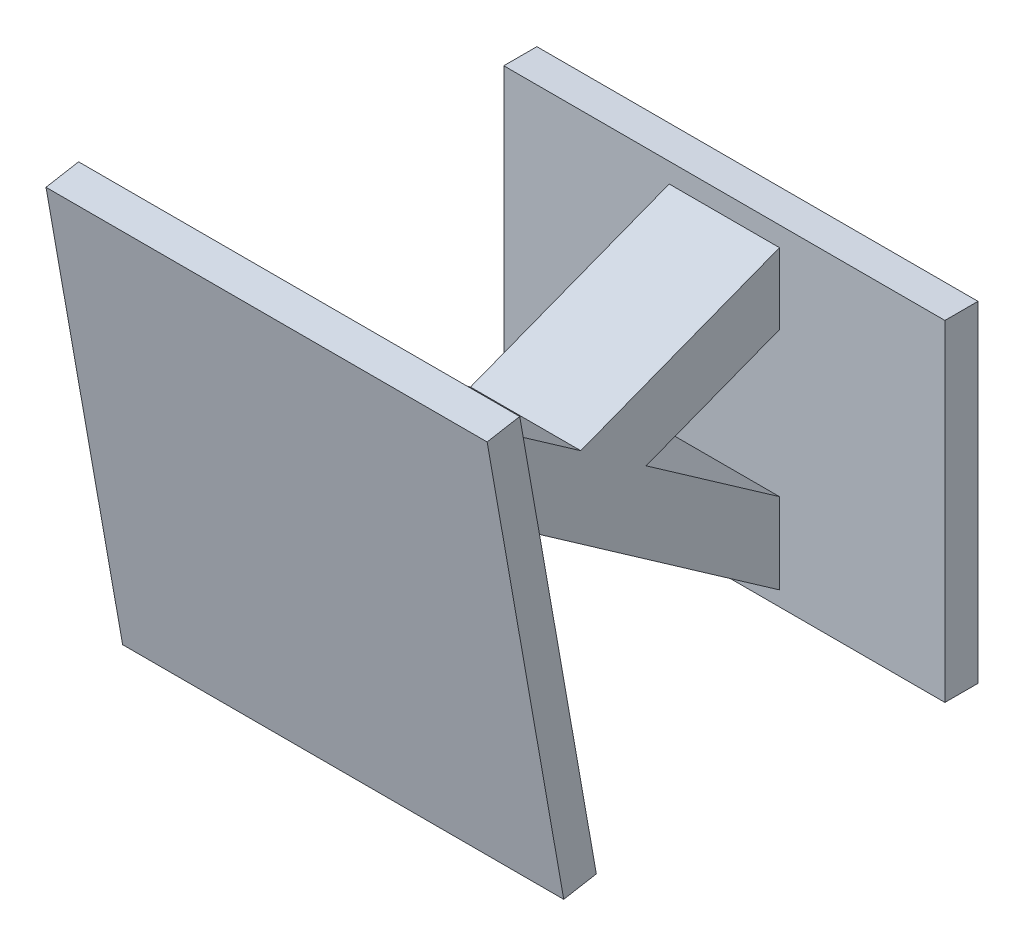
ISO-10303-21;
HEADER;
FILE_DESCRIPTION(('STEP AP214'),'2;1');
FILE_NAME('part.step','',(''),(''),'','','');
FILE_SCHEMA(('AUTOMOTIVE_DESIGN { 1 0 10303 214 1 1 1 1 }'));
ENDSEC;
DATA;
#1=APPLICATION_CONTEXT('core data for automotive mechanical design processes');
#2=APPLICATION_PROTOCOL_DEFINITION('international standard','automotive_design',2000,#1);
#3=PRODUCT_CONTEXT('',#1,'mechanical');
#4=PRODUCT('Part','Part','',(#3));
#5=PRODUCT_RELATED_PRODUCT_CATEGORY('part','',(#4));
#6=PRODUCT_DEFINITION_FORMATION('','',#4);
#7=PRODUCT_DEFINITION_CONTEXT('part definition',#1,'design');
#8=PRODUCT_DEFINITION('design','',#6,#7);
#9=PRODUCT_DEFINITION_SHAPE('','',#8);
#10=(LENGTH_UNIT() NAMED_UNIT(*) SI_UNIT(.MILLI.,.METRE.));
#11=(NAMED_UNIT(*) PLANE_ANGLE_UNIT() SI_UNIT($,.RADIAN.));
#12=(NAMED_UNIT(*) SI_UNIT($,.STERADIAN.) SOLID_ANGLE_UNIT());
#13=UNCERTAINTY_MEASURE_WITH_UNIT(LENGTH_MEASURE(1.E-05),#10,'distance_accuracy_value','');
#14=(GEOMETRIC_REPRESENTATION_CONTEXT(3) GLOBAL_UNCERTAINTY_ASSIGNED_CONTEXT((#13)) GLOBAL_UNIT_ASSIGNED_CONTEXT((#10,
#11,#12)) REPRESENTATION_CONTEXT('',''));
#15=CARTESIAN_POINT('',(0.,0.,0.));
#16=DIRECTION('',(0.,0.,1.));
#17=DIRECTION('',(1.,0.,0.));
#18=AXIS2_PLACEMENT_3D('',#15,#16,#17);
#19=CARTESIAN_POINT('',(5.,-76.5805388747842,53.6222706002861));
#20=DIRECTION('',(0.,-0.81915204428899,0.573576436351049));
#21=DIRECTION('',(0.,-0.573576436351049,-0.81915204428899));
#22=AXIS2_PLACEMENT_3D('',#19,#20,#21);
#23=PLANE('',#22);
#24=DIRECTION('',(0.,0.573576436351049,0.81915204428899));
#25=VECTOR('',#24,1.);
#26=CARTESIAN_POINT('',(-5.,-76.5805388747842,53.6222706002861));
#27=LINE('',#26,#25);
#28=CARTESIAN_POINT('',(-5.,-99.4100833515098,21.0183021610203));
#29=VERTEX_POINT('',#28);
#30=CARTESIAN_POINT('',(-5.,-85.8848490507101,40.3343385684273));
#31=VERTEX_POINT('',#30);
#32=EDGE_CURVE('E226',#29,#31,#27,.T.);
#33=ORIENTED_EDGE('',*,*,#32,.T.);
#34=DIRECTION('',(-1.,0.,0.));
#35=VECTOR('',#34,1.);
#36=CARTESIAN_POINT('',(5.,-85.8848490507101,40.3343385684273));
#37=LINE('',#36,#35);
#38=CARTESIAN_POINT('',(5.,-85.8848490507101,40.3343385684273));
#39=VERTEX_POINT('',#38);
#40=EDGE_CURVE('E11',#39,#31,#37,.T.);
#41=ORIENTED_EDGE('',*,*,#40,.F.);
#42=DIRECTION('',(0.,0.573576436351049,0.81915204428899));
#43=VECTOR('',#42,1.);
#44=CARTESIAN_POINT('',(5.,-76.5805388747842,53.6222706002861));
#45=LINE('',#44,#43);
#46=CARTESIAN_POINT('',(5.,-99.4100833515098,21.0183021610203));
#47=VERTEX_POINT('',#46);
#48=EDGE_CURVE('E89',#47,#39,#45,.T.);
#49=ORIENTED_EDGE('',*,*,#48,.F.);
#50=DIRECTION('',(-1.,0.,0.));
#51=VECTOR('',#50,1.);
#52=CARTESIAN_POINT('',(5.,-99.4100833515098,21.0183021610203));
#53=LINE('',#52,#51);
#54=EDGE_CURVE('E242',#47,#29,#53,.T.);
#55=ORIENTED_EDGE('',*,*,#54,.T.);
#56=EDGE_LOOP('',(#33,#41,#49,#55));
#57=FACE_BOUND('',#56,.T.);
#58=ADVANCED_FACE('F39',(#57),#23,.F.);
#59=CARTESIAN_POINT('',(5.,-81.4954511405181,57.0637292183924));
#60=DIRECTION('',(0.,-0.819152044288989,0.57357643635105));
#61=DIRECTION('',(0.,-0.57357643635105,-0.819152044288989));
#62=AXIS2_PLACEMENT_3D('',#59,#60,#61);
#63=PLANE('',#62);
#64=DIRECTION('',(0.,0.57357643635105,0.819152044288989));
#65=VECTOR('',#64,1.);
#66=CARTESIAN_POINT('',(-5.,-81.4954511405181,57.0637292183924));
#67=LINE('',#66,#65);
#68=CARTESIAN_POINT('',(-5.,-119.351281882965,3.));
#69=VERTEX_POINT('',#68);
#70=CARTESIAN_POINT('',(-5.,-94.2412199345503,38.8608849207996));
#71=VERTEX_POINT('',#70);
#72=EDGE_CURVE('E248',#69,#71,#67,.T.);
#73=ORIENTED_EDGE('',*,*,#72,.F.);
#74=DIRECTION('',(-1.,0.,0.));
#75=VECTOR('',#74,1.);
#76=CARTESIAN_POINT('',(5.,-119.351281882965,3.));
#77=LINE('',#76,#75);
#78=CARTESIAN_POINT('',(5.,-119.351281882965,3.));
#79=VERTEX_POINT('',#78);
#80=EDGE_CURVE('E270',#79,#69,#77,.T.);
#81=ORIENTED_EDGE('',*,*,#80,.F.);
#82=DIRECTION('',(0.,0.57357643635105,0.819152044288989));
#83=VECTOR('',#82,1.);
#84=CARTESIAN_POINT('',(5.,-81.4954511405181,57.0637292183924));
#85=LINE('',#84,#83);
#86=CARTESIAN_POINT('',(5.,-94.2412199345503,38.8608849207996));
#87=VERTEX_POINT('',#86);
#88=EDGE_CURVE('E230',#79,#87,#85,.T.);
#89=ORIENTED_EDGE('',*,*,#88,.T.);
#90=DIRECTION('',(-1.,0.,0.));
#91=VECTOR('',#90,1.);
#92=CARTESIAN_POINT('',(5.,-94.2412199345503,38.8608849207996));
#93=LINE('',#92,#91);
#94=EDGE_CURVE('E47',#87,#71,#93,.T.);
#95=ORIENTED_EDGE('',*,*,#94,.T.);
#96=EDGE_LOOP('',(#73,#81,#89,#95));
#97=FACE_BOUND('',#96,.T.);
#98=ADVANCED_FACE('F275',(#97),#63,.T.);
#99=CARTESIAN_POINT('',(5.,-76.5805388747841,53.6222706002862));
#100=DIRECTION('',(0.,-0.819152044288989,0.57357643635105));
#101=DIRECTION('',(0.,-0.57357643635105,-0.819152044288989));
#102=AXIS2_PLACEMENT_3D('',#99,#100,#101);
#103=PLANE('',#102);
#104=DIRECTION('',(0.,0.57357643635105,0.819152044288989));
#105=VECTOR('',#104,1.);
#106=CARTESIAN_POINT('',(-5.,-76.5805388747841,53.6222706002862));
#107=LINE('',#106,#105);
#108=CARTESIAN_POINT('',(-5.,-112.026634350397,3.));
#109=VERTEX_POINT('',#108);
#110=CARTESIAN_POINT('',(-5.,-103.558646596402,15.0935398319842));
#111=VERTEX_POINT('',#110);
#112=EDGE_CURVE('E253',#109,#111,#107,.T.);
#113=ORIENTED_EDGE('',*,*,#112,.T.);
#114=DIRECTION('',(-1.,0.,0.));
#115=VECTOR('',#114,1.);
#116=CARTESIAN_POINT('',(5.,-103.558646596402,15.0935398319842));
#117=LINE('',#116,#115);
#118=CARTESIAN_POINT('',(5.,-103.558646596402,15.0935398319842));
#119=VERTEX_POINT('',#118);
#120=EDGE_CURVE('E265',#119,#111,#117,.T.);
#121=ORIENTED_EDGE('',*,*,#120,.F.);
#122=DIRECTION('',(0.,0.57357643635105,0.819152044288989));
#123=VECTOR('',#122,1.);
#124=CARTESIAN_POINT('',(5.,-76.5805388747841,53.6222706002862));
#125=LINE('',#124,#123);
#126=CARTESIAN_POINT('',(5.,-112.026634350397,3.));
#127=VERTEX_POINT('',#126);
#128=EDGE_CURVE('E235',#127,#119,#125,.T.);
#129=ORIENTED_EDGE('',*,*,#128,.F.);
#130=DIRECTION('',(-1.,0.,0.));
#131=VECTOR('',#130,1.);
#132=CARTESIAN_POINT('',(5.,-112.026634350397,3.));
#133=LINE('',#132,#131);
#134=EDGE_CURVE('E267',#127,#109,#133,.T.);
#135=ORIENTED_EDGE('',*,*,#134,.T.);
#136=EDGE_LOOP('',(#113,#121,#129,#135));
#137=FACE_BOUND('',#136,.T.);
#138=ADVANCED_FACE('F295',(#137),#103,.F.);
#139=CARTESIAN_POINT('',(5.,-85.1345748268788,-32.7704627871978));
#140=DIRECTION('',(0.,-0.93324862532507,-0.359231128006562));
#141=DIRECTION('',(0.,0.359231128006562,-0.93324862532507));
#142=AXIS2_PLACEMENT_3D('',#139,#140,#141);
#143=PLANE('',#142);
#144=DIRECTION('',(0.,-0.359231128006562,0.93324862532507));
#145=VECTOR('',#144,1.);
#146=CARTESIAN_POINT('',(-5.,-85.1345748268788,-32.7704627871978));
#147=LINE('',#146,#145);
#148=CARTESIAN_POINT('',(-5.,-98.9035355814537,3.));
#149=VERTEX_POINT('',#148);
#150=EDGE_CURVE('E257',#149,#111,#147,.T.);
#151=ORIENTED_EDGE('',*,*,#150,.F.);
#152=DIRECTION('',(-1.,0.,0.));
#153=VECTOR('',#152,1.);
#154=CARTESIAN_POINT('',(5.,-98.9035355814537,3.));
#155=LINE('',#154,#153);
#156=CARTESIAN_POINT('',(5.,-98.9035355814537,3.));
#157=VERTEX_POINT('',#156);
#158=EDGE_CURVE('E77',#157,#149,#155,.T.);
#159=ORIENTED_EDGE('',*,*,#158,.F.);
#160=DIRECTION('',(0.,-0.359231128006562,0.93324862532507));
#161=VECTOR('',#160,1.);
#162=CARTESIAN_POINT('',(5.,-85.1345748268788,-32.7704627871978));
#163=LINE('',#162,#161);
#164=EDGE_CURVE('E238',#157,#119,#163,.T.);
#165=ORIENTED_EDGE('',*,*,#164,.T.);
#166=ORIENTED_EDGE('',*,*,#120,.T.);
#167=EDGE_LOOP('',(#151,#159,#165,#166));
#168=FACE_BOUND('',#167,.T.);
#169=ADVANCED_FACE('F290',(#168),#143,.T.);
#170=CARTESIAN_POINT('',(5.,-79.5350830749284,-30.6150760191584));
#171=DIRECTION('',(0.,-0.93324862532507,-0.359231128006561));
#172=DIRECTION('',(0.,0.359231128006561,-0.93324862532507));
#173=AXIS2_PLACEMENT_3D('',#170,#171,#172);
#174=PLANE('',#173);
#175=DIRECTION('',(0.,-0.359231128006561,0.93324862532507));
#176=VECTOR('',#175,1.);
#177=CARTESIAN_POINT('',(-5.,-79.5350830749284,-30.6150760191584));
#178=LINE('',#177,#176);
#179=CARTESIAN_POINT('',(-5.,-92.4743806519084,3.));
#180=VERTEX_POINT('',#179);
#181=EDGE_CURVE('E84',#180,#29,#178,.T.);
#182=ORIENTED_EDGE('',*,*,#181,.T.);
#183=ORIENTED_EDGE('',*,*,#54,.F.);
#184=DIRECTION('',(0.,-0.359231128006561,0.93324862532507));
#185=VECTOR('',#184,1.);
#186=CARTESIAN_POINT('',(5.,-79.5350830749284,-30.6150760191584));
#187=LINE('',#186,#185);
#188=CARTESIAN_POINT('',(5.,-92.4743806519084,3.));
#189=VERTEX_POINT('',#188);
#190=EDGE_CURVE('E55',#189,#47,#187,.T.);
#191=ORIENTED_EDGE('',*,*,#190,.F.);
#192=DIRECTION('',(-1.,0.,0.));
#193=VECTOR('',#192,1.);
#194=CARTESIAN_POINT('',(5.,-92.4743806519084,3.));
#195=LINE('',#194,#193);
#196=EDGE_CURVE('E262',#189,#180,#195,.T.);
#197=ORIENTED_EDGE('',*,*,#196,.T.);
#198=EDGE_LOOP('',(#182,#183,#191,#197));
#199=FACE_BOUND('',#198,.T.);
#200=ADVANCED_FACE('F284',(#199),#174,.F.);
#201=CARTESIAN_POINT('',(5.,0.,0.));
#202=DIRECTION('',(1.,0.,0.));
#203=DIRECTION('',(0.,0.,-1.));
#204=AXIS2_PLACEMENT_3D('',#201,#202,#203);
#205=PLANE('',#204);
#206=ORIENTED_EDGE('',*,*,#48,.T.);
#207=DIRECTION('',(0.,-0.984807753012208,-0.173648177666931));
#208=VECTOR('',#207,1.);
#209=CARTESIAN_POINT('',(5.,-9.48732320928291,53.8052836336431));
#210=LINE('',#209,#208);
#211=EDGE_CURVE('E228',#39,#87,#210,.T.);
#212=ORIENTED_EDGE('',*,*,#211,.T.);
#213=ORIENTED_EDGE('',*,*,#88,.F.);
#214=DIRECTION('',(0.,-1.,0.));
#215=VECTOR('',#214,1.);
#216=CARTESIAN_POINT('',(5.,0.,3.));
#217=LINE('',#216,#215);
#218=EDGE_CURVE('E233',#127,#79,#217,.T.);
#219=ORIENTED_EDGE('',*,*,#218,.F.);
#220=ORIENTED_EDGE('',*,*,#128,.T.);
#221=ORIENTED_EDGE('',*,*,#164,.F.);
#222=EDGE_CURVE('E236',#189,#157,#217,.T.);
#223=ORIENTED_EDGE('',*,*,#222,.F.);
#224=ORIENTED_EDGE('',*,*,#190,.T.);
#225=EDGE_LOOP('',(#206,#212,#213,#219,#220,#221,#223,#224));
#226=FACE_BOUND('',#225,.T.);
#227=ADVANCED_FACE('F286',(#226),#205,.T.);
#228=CARTESIAN_POINT('',(-5.,0.,0.));
#229=DIRECTION('',(1.,0.,0.));
#230=DIRECTION('',(0.,0.,-1.));
#231=AXIS2_PLACEMENT_3D('',#228,#229,#230);
#232=PLANE('',#231);
#233=ORIENTED_EDGE('',*,*,#32,.F.);
#234=ORIENTED_EDGE('',*,*,#181,.F.);
#235=DIRECTION('',(0.,-1.,0.));
#236=VECTOR('',#235,1.);
#237=CARTESIAN_POINT('',(-5.,0.,3.));
#238=LINE('',#237,#236);
#239=EDGE_CURVE('E254',#180,#149,#238,.T.);
#240=ORIENTED_EDGE('',*,*,#239,.T.);
#241=ORIENTED_EDGE('',*,*,#150,.T.);
#242=ORIENTED_EDGE('',*,*,#112,.F.);
#243=EDGE_CURVE('E250',#109,#69,#238,.T.);
#244=ORIENTED_EDGE('',*,*,#243,.T.);
#245=ORIENTED_EDGE('',*,*,#72,.T.);
#246=DIRECTION('',(0.,-0.984807753012208,-0.173648177666931));
#247=VECTOR('',#246,1.);
#248=CARTESIAN_POINT('',(-5.,-9.48732320928291,53.8052836336431));
#249=LINE('',#248,#247);
#250=EDGE_CURVE('E245',#31,#71,#249,.T.);
#251=ORIENTED_EDGE('',*,*,#250,.F.);
#252=EDGE_LOOP('',(#233,#234,#240,#241,#242,#244,#245,#251));
#253=FACE_BOUND('',#252,.T.);
#254=ADVANCED_FACE('F282',(#253),#232,.F.);
#255=CARTESIAN_POINT('',(20.,0.,0.));
#256=DIRECTION('',(0.,0.,1.));
#257=DIRECTION('',(0.,-1.,0.));
#258=AXIS2_PLACEMENT_3D('',#255,#256,#257);
#259=PLANE('',#258);
#260=DIRECTION('',(0.,1.,0.));
#261=VECTOR('',#260,1.);
#262=CARTESIAN_POINT('',(-20.,0.,0.));
#263=LINE('',#262,#261);
#264=CARTESIAN_POINT('',(-20.,-120.688958116681,0.));
#265=VERTEX_POINT('',#264);
#266=CARTESIAN_POINT('',(-20.,-90.688958116681,0.));
#267=VERTEX_POINT('',#266);
#268=EDGE_CURVE('E186',#265,#267,#263,.T.);
#269=ORIENTED_EDGE('',*,*,#268,.T.);
#270=DIRECTION('',(-1.,0.,0.));
#271=VECTOR('',#270,1.);
#272=CARTESIAN_POINT('',(20.,-90.688958116681,0.));
#273=LINE('',#272,#271);
#274=CARTESIAN_POINT('',(20.,-90.688958116681,0.));
#275=VERTEX_POINT('',#274);
#276=EDGE_CURVE('E223',#275,#267,#273,.T.);
#277=ORIENTED_EDGE('',*,*,#276,.F.);
#278=DIRECTION('',(0.,1.,0.));
#279=VECTOR('',#278,1.);
#280=CARTESIAN_POINT('',(20.,0.,0.));
#281=LINE('',#280,#279);
#282=CARTESIAN_POINT('',(20.,-120.688958116681,0.));
#283=VERTEX_POINT('',#282);
#284=EDGE_CURVE('E200',#283,#275,#281,.T.);
#285=ORIENTED_EDGE('',*,*,#284,.F.);
#286=DIRECTION('',(-1.,0.,0.));
#287=VECTOR('',#286,1.);
#288=CARTESIAN_POINT('',(20.,-120.688958116681,0.));
#289=LINE('',#288,#287);
#290=EDGE_CURVE('E209',#283,#265,#289,.T.);
#291=ORIENTED_EDGE('',*,*,#290,.T.);
#292=EDGE_LOOP('',(#269,#277,#285,#291));
#293=FACE_BOUND('',#292,.T.);
#294=ADVANCED_FACE('F310',(#293),#259,.F.);
#295=CARTESIAN_POINT('',(20.,-90.688958116681,0.));
#296=DIRECTION('',(0.,-1.,0.));
#297=DIRECTION('',(0.,0.,-1.));
#298=AXIS2_PLACEMENT_3D('',#295,#296,#297);
#299=PLANE('',#298);
#300=DIRECTION('',(0.,0.,1.));
#301=VECTOR('',#300,1.);
#302=CARTESIAN_POINT('',(-20.,-90.688958116681,0.));
#303=LINE('',#302,#301);
#304=CARTESIAN_POINT('',(-20.,-90.688958116681,3.));
#305=VERTEX_POINT('',#304);
#306=EDGE_CURVE('E189',#267,#305,#303,.T.);
#307=ORIENTED_EDGE('',*,*,#306,.T.);
#308=DIRECTION('',(-1.,0.,0.));
#309=VECTOR('',#308,1.);
#310=CARTESIAN_POINT('',(20.,-90.688958116681,3.));
#311=LINE('',#310,#309);
#312=CARTESIAN_POINT('',(20.,-90.688958116681,3.));
#313=VERTEX_POINT('',#312);
#314=EDGE_CURVE('E220',#313,#305,#311,.T.);
#315=ORIENTED_EDGE('',*,*,#314,.F.);
#316=DIRECTION('',(0.,0.,1.));
#317=VECTOR('',#316,1.);
#318=CARTESIAN_POINT('',(20.,-90.688958116681,0.));
#319=LINE('',#318,#317);
#320=EDGE_CURVE('E203',#275,#313,#319,.T.);
#321=ORIENTED_EDGE('',*,*,#320,.F.);
#322=ORIENTED_EDGE('',*,*,#276,.T.);
#323=EDGE_LOOP('',(#307,#315,#321,#322));
#324=FACE_BOUND('',#323,.T.);
#325=ADVANCED_FACE('F301',(#324),#299,.F.);
#326=CARTESIAN_POINT('',(20.,0.,3.));
#327=DIRECTION('',(0.,0.,-1.));
#328=DIRECTION('',(-1.,0.,0.));
#329=AXIS2_PLACEMENT_3D('',#326,#327,#328);
#330=PLANE('',#329);
#331=ORIENTED_EDGE('',*,*,#218,.T.);
#332=ORIENTED_EDGE('',*,*,#80,.T.);
#333=ORIENTED_EDGE('',*,*,#243,.F.);
#334=ORIENTED_EDGE('',*,*,#134,.F.);
#335=EDGE_LOOP('',(#331,#332,#333,#334));
#336=FACE_BOUND('',#335,.T.);
#337=ORIENTED_EDGE('',*,*,#222,.T.);
#338=ORIENTED_EDGE('',*,*,#158,.T.);
#339=ORIENTED_EDGE('',*,*,#239,.F.);
#340=ORIENTED_EDGE('',*,*,#196,.F.);
#341=EDGE_LOOP('',(#337,#338,#339,#340));
#342=FACE_BOUND('',#341,.T.);
#343=DIRECTION('',(0.,-1.,0.));
#344=VECTOR('',#343,1.);
#345=CARTESIAN_POINT('',(-20.,0.,3.));
#346=LINE('',#345,#344);
#347=CARTESIAN_POINT('',(-20.,-120.688958116681,3.));
#348=VERTEX_POINT('',#347);
#349=EDGE_CURVE('E212',#305,#348,#346,.T.);
#350=ORIENTED_EDGE('',*,*,#349,.T.);
#351=DIRECTION('',(-1.,0.,0.));
#352=VECTOR('',#351,1.);
#353=CARTESIAN_POINT('',(20.,-120.688958116681,3.));
#354=LINE('',#353,#352);
#355=CARTESIAN_POINT('',(20.,-120.688958116681,3.));
#356=VERTEX_POINT('',#355);
#357=EDGE_CURVE('E217',#356,#348,#354,.T.);
#358=ORIENTED_EDGE('',*,*,#357,.F.);
#359=DIRECTION('',(0.,-1.,0.));
#360=VECTOR('',#359,1.);
#361=CARTESIAN_POINT('',(20.,0.,3.));
#362=LINE('',#361,#360);
#363=EDGE_CURVE('E206',#313,#356,#362,.T.);
#364=ORIENTED_EDGE('',*,*,#363,.F.);
#365=ORIENTED_EDGE('',*,*,#314,.T.);
#366=EDGE_LOOP('',(#350,#358,#364,#365));
#367=FACE_BOUND('',#366,.T.);
#368=ADVANCED_FACE('F287',(#336,#342,#367),#330,.F.);
#369=CARTESIAN_POINT('',(20.,-120.688958116681,0.));
#370=DIRECTION('',(0.,1.,0.));
#371=DIRECTION('',(0.,0.,1.));
#372=AXIS2_PLACEMENT_3D('',#369,#370,#371);
#373=PLANE('',#372);
#374=DIRECTION('',(0.,0.,-1.));
#375=VECTOR('',#374,1.);
#376=CARTESIAN_POINT('',(-20.,-120.688958116681,0.));
#377=LINE('',#376,#375);
#378=EDGE_CURVE('E204',#348,#265,#377,.T.);
#379=ORIENTED_EDGE('',*,*,#378,.T.);
#380=ORIENTED_EDGE('',*,*,#290,.F.);
#381=DIRECTION('',(0.,0.,-1.));
#382=VECTOR('',#381,1.);
#383=CARTESIAN_POINT('',(20.,-120.688958116681,0.));
#384=LINE('',#383,#382);
#385=EDGE_CURVE('E208',#356,#283,#384,.T.);
#386=ORIENTED_EDGE('',*,*,#385,.F.);
#387=ORIENTED_EDGE('',*,*,#357,.T.);
#388=EDGE_LOOP('',(#379,#380,#386,#387));
#389=FACE_BOUND('',#388,.T.);
#390=ADVANCED_FACE('F300',(#389),#373,.F.);
#391=CARTESIAN_POINT('',(20.,0.,0.));
#392=DIRECTION('',(1.,0.,0.));
#393=DIRECTION('',(0.,0.,-1.));
#394=AXIS2_PLACEMENT_3D('',#391,#392,#393);
#395=PLANE('',#394);
#396=ORIENTED_EDGE('',*,*,#284,.T.);
#397=ORIENTED_EDGE('',*,*,#320,.T.);
#398=ORIENTED_EDGE('',*,*,#363,.T.);
#399=ORIENTED_EDGE('',*,*,#385,.T.);
#400=EDGE_LOOP('',(#396,#397,#398,#399));
#401=FACE_BOUND('',#400,.T.);
#402=ADVANCED_FACE('F307',(#401),#395,.T.);
#403=CARTESIAN_POINT('',(-20.,0.,0.));
#404=DIRECTION('',(1.,0.,0.));
#405=DIRECTION('',(0.,0.,-1.));
#406=AXIS2_PLACEMENT_3D('',#403,#404,#405);
#407=PLANE('',#406);
#408=ORIENTED_EDGE('',*,*,#268,.F.);
#409=ORIENTED_EDGE('',*,*,#378,.F.);
#410=ORIENTED_EDGE('',*,*,#349,.F.);
#411=ORIENTED_EDGE('',*,*,#306,.F.);
#412=EDGE_LOOP('',(#408,#409,#410,#411));
#413=FACE_BOUND('',#412,.T.);
#414=ADVANCED_FACE('F340',(#413),#407,.F.);
#415=CARTESIAN_POINT('',(20.,-78.9549816397825,41.5562611657062));
#416=DIRECTION('',(0.,-0.984807753012207,-0.173648177666935));
#417=DIRECTION('',(0.,0.173648177666935,-0.984807753012207));
#418=AXIS2_PLACEMENT_3D('',#415,#416,#417);
#419=PLANE('',#418);
#420=DIRECTION('',(0.,-0.173648177666935,0.984807753012207));
#421=VECTOR('',#420,1.);
#422=CARTESIAN_POINT('',(-20.,-78.9549816397825,41.5562611657062));
#423=LINE('',#422,#421);
#424=CARTESIAN_POINT('',(-20.,-78.9549816397825,41.5562611657062));
#425=VERTEX_POINT('',#424);
#426=CARTESIAN_POINT('',(-20.,-79.4759261727833,44.5106844247428));
#427=VERTEX_POINT('',#426);
#428=EDGE_CURVE('E179',#425,#427,#423,.T.);
#429=ORIENTED_EDGE('',*,*,#428,.T.);
#430=DIRECTION('',(-1.,0.,0.));
#431=VECTOR('',#430,1.);
#432=CARTESIAN_POINT('',(20.,-79.4759261727833,44.5106844247428));
#433=LINE('',#432,#431);
#434=CARTESIAN_POINT('',(20.,-79.4759261727833,44.5106844247428));
#435=VERTEX_POINT('',#434);
#436=EDGE_CURVE('E517',#435,#427,#433,.T.);
#437=ORIENTED_EDGE('',*,*,#436,.F.);
#438=DIRECTION('',(0.,-0.173648177666935,0.984807753012207));
#439=VECTOR('',#438,1.);
#440=CARTESIAN_POINT('',(20.,-78.9549816397825,41.5562611657062));
#441=LINE('',#440,#439);
#442=CARTESIAN_POINT('',(20.,-78.9549816397825,41.5562611657062));
#443=VERTEX_POINT('',#442);
#444=EDGE_CURVE('E173',#443,#435,#441,.T.);
#445=ORIENTED_EDGE('',*,*,#444,.F.);
#446=DIRECTION('',(-1.,0.,0.));
#447=VECTOR('',#446,1.);
#448=CARTESIAN_POINT('',(20.,-78.9549816397825,41.5562611657062));
#449=LINE('',#448,#447);
#450=EDGE_CURVE('E165',#443,#425,#449,.T.);
#451=ORIENTED_EDGE('',*,*,#450,.T.);
#452=EDGE_LOOP('',(#429,#437,#445,#451));
#453=FACE_BOUND('',#452,.T.);
#454=ADVANCED_FACE('F177',(#453),#419,.F.);
#455=CARTESIAN_POINT('',(20.,-79.4759261727833,44.5106844247428));
#456=DIRECTION('',(0.,0.173648177666931,-0.984807753012208));
#457=DIRECTION('',(0.,0.984807753012208,0.173648177666931));
#458=AXIS2_PLACEMENT_3D('',#455,#456,#457);
#459=PLANE('',#458);
#460=DIRECTION('',(0.,-0.984807753012208,-0.173648177666931));
#461=VECTOR('',#460,1.);
#462=CARTESIAN_POINT('',(-20.,-79.4759261727833,44.5106844247428));
#463=LINE('',#462,#461);
#464=CARTESIAN_POINT('',(-20.,-118.868236293272,37.5647573180656));
#465=VERTEX_POINT('',#464);
#466=EDGE_CURVE('E184',#427,#465,#463,.T.);
#467=ORIENTED_EDGE('',*,*,#466,.T.);
#468=DIRECTION('',(-1.,0.,0.));
#469=VECTOR('',#468,1.);
#470=CARTESIAN_POINT('',(20.,-118.868236293272,37.5647573180656));
#471=LINE('',#470,#469);
#472=CARTESIAN_POINT('',(20.,-118.868236293272,37.5647573180656));
#473=VERTEX_POINT('',#472);
#474=EDGE_CURVE('E515',#473,#465,#471,.T.);
#475=ORIENTED_EDGE('',*,*,#474,.F.);
#476=DIRECTION('',(0.,-0.984807753012208,-0.173648177666931));
#477=VECTOR('',#476,1.);
#478=CARTESIAN_POINT('',(20.,-79.4759261727833,44.5106844247428));
#479=LINE('',#478,#477);
#480=EDGE_CURVE('E197',#435,#473,#479,.T.);
#481=ORIENTED_EDGE('',*,*,#480,.F.);
#482=ORIENTED_EDGE('',*,*,#436,.T.);
#483=EDGE_LOOP('',(#467,#475,#481,#482));
#484=FACE_BOUND('',#483,.T.);
#485=ADVANCED_FACE('F365',(#484),#459,.F.);
#486=CARTESIAN_POINT('',(20.,-118.868236293272,37.5647573180656));
#487=DIRECTION('',(0.,0.984807753012207,0.173648177666935));
#488=DIRECTION('',(0.,-0.173648177666935,0.984807753012207));
#489=AXIS2_PLACEMENT_3D('',#486,#487,#488);
#490=PLANE('',#489);
#491=DIRECTION('',(0.,0.173648177666935,-0.984807753012207));
#492=VECTOR('',#491,1.);
#493=CARTESIAN_POINT('',(-20.,-118.868236293272,37.5647573180656));
#494=LINE('',#493,#492);
#495=CARTESIAN_POINT('',(-20.,-118.347291760271,34.6103340590289));
#496=VERTEX_POINT('',#495);
#497=EDGE_CURVE('E172',#465,#496,#494,.T.);
#498=ORIENTED_EDGE('',*,*,#497,.T.);
#499=DIRECTION('',(-1.,0.,0.));
#500=VECTOR('',#499,1.);
#501=CARTESIAN_POINT('',(20.,-118.347291760271,34.6103340590289));
#502=LINE('',#501,#500);
#503=CARTESIAN_POINT('',(20.,-118.347291760271,34.6103340590289));
#504=VERTEX_POINT('',#503);
#505=EDGE_CURVE('E168',#504,#496,#502,.T.);
#506=ORIENTED_EDGE('',*,*,#505,.F.);
#507=DIRECTION('',(0.,0.173648177666935,-0.984807753012207));
#508=VECTOR('',#507,1.);
#509=CARTESIAN_POINT('',(20.,-118.868236293272,37.5647573180656));
#510=LINE('',#509,#508);
#511=EDGE_CURVE('E195',#473,#504,#510,.T.);
#512=ORIENTED_EDGE('',*,*,#511,.F.);
#513=ORIENTED_EDGE('',*,*,#474,.T.);
#514=EDGE_LOOP('',(#498,#506,#512,#513));
#515=FACE_BOUND('',#514,.T.);
#516=ADVANCED_FACE('F362',(#515),#490,.F.);
#517=CARTESIAN_POINT('',(20.,-118.347291760271,34.6103340590289));
#518=DIRECTION('',(0.,-0.173648177666931,0.984807753012208));
#519=DIRECTION('',(0.,-0.984807753012208,-0.173648177666931));
#520=AXIS2_PLACEMENT_3D('',#517,#518,#519);
#521=PLANE('',#520);
#522=ORIENTED_EDGE('',*,*,#211,.F.);
#523=ORIENTED_EDGE('',*,*,#40,.T.);
#524=ORIENTED_EDGE('',*,*,#250,.T.);
#525=ORIENTED_EDGE('',*,*,#94,.F.);
#526=EDGE_LOOP('',(#522,#523,#524,#525));
#527=FACE_BOUND('',#526,.T.);
#528=DIRECTION('',(0.,0.984807753012208,0.173648177666931));
#529=VECTOR('',#528,1.);
#530=CARTESIAN_POINT('',(-20.,-118.347291760271,34.6103340590289));
#531=LINE('',#530,#529);
#532=EDGE_CURVE('E161',#496,#425,#531,.T.);
#533=ORIENTED_EDGE('',*,*,#532,.T.);
#534=ORIENTED_EDGE('',*,*,#450,.F.);
#535=DIRECTION('',(0.,0.984807753012208,0.173648177666931));
#536=VECTOR('',#535,1.);
#537=CARTESIAN_POINT('',(20.,-118.347291760271,34.6103340590289));
#538=LINE('',#537,#536);
#539=EDGE_CURVE('E181',#504,#443,#538,.T.);
#540=ORIENTED_EDGE('',*,*,#539,.F.);
#541=ORIENTED_EDGE('',*,*,#505,.T.);
#542=EDGE_LOOP('',(#533,#534,#540,#541));
#543=FACE_BOUND('',#542,.T.);
#544=ADVANCED_FACE('F163',(#527,#543),#521,.F.);
#545=CARTESIAN_POINT('',(20.,0.,0.));
#546=DIRECTION('',(1.,0.,0.));
#547=DIRECTION('',(0.,0.,-1.));
#548=AXIS2_PLACEMENT_3D('',#545,#546,#547);
#549=PLANE('',#548);
#550=ORIENTED_EDGE('',*,*,#444,.T.);
#551=ORIENTED_EDGE('',*,*,#480,.T.);
#552=ORIENTED_EDGE('',*,*,#511,.T.);
#553=ORIENTED_EDGE('',*,*,#539,.T.);
#554=EDGE_LOOP('',(#550,#551,#552,#553));
#555=FACE_BOUND('',#554,.T.);
#556=ADVANCED_FACE('F354',(#555),#549,.T.);
#557=CARTESIAN_POINT('',(-20.,0.,0.));
#558=DIRECTION('',(1.,0.,0.));
#559=DIRECTION('',(0.,0.,-1.));
#560=AXIS2_PLACEMENT_3D('',#557,#558,#559);
#561=PLANE('',#560);
#562=ORIENTED_EDGE('',*,*,#428,.F.);
#563=ORIENTED_EDGE('',*,*,#532,.F.);
#564=ORIENTED_EDGE('',*,*,#497,.F.);
#565=ORIENTED_EDGE('',*,*,#466,.F.);
#566=EDGE_LOOP('',(#562,#563,#564,#565));
#567=FACE_BOUND('',#566,.T.);
#568=ADVANCED_FACE('F183',(#567),#561,.F.);
#569=CLOSED_SHELL('',(#58,#98,#138,#169,#200,#227,#254,#294,#325,#368,#390,#402,#414,#454,#485,
#516,#544,#556,#568));
#570=MANIFOLD_SOLID_BREP('B2',#569);
#571=ADVANCED_BREP_SHAPE_REPRESENTATION('',(#18,#570),#14);
#572=SHAPE_DEFINITION_REPRESENTATION(#9,#571);
ENDSEC;
END-ISO-10303-21;
